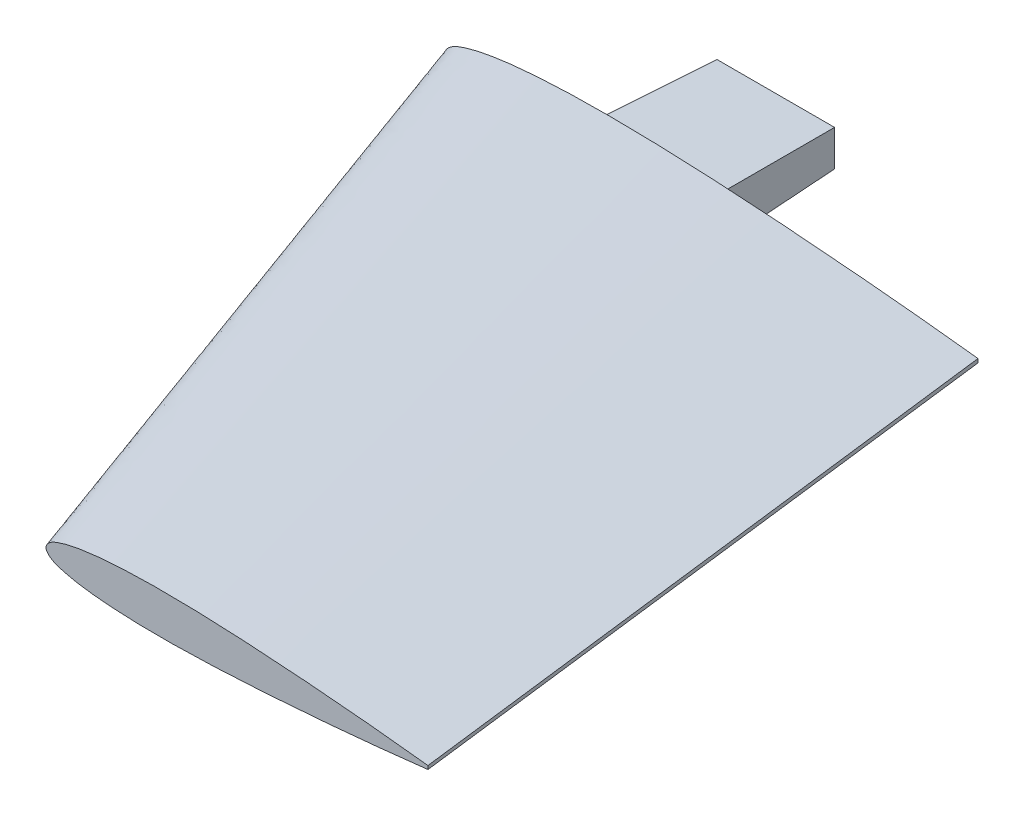
ISO-10303-21;
HEADER;
FILE_DESCRIPTION(('STEP AP214'),'2;1');
FILE_NAME('part.step','',(''),(''),'','','');
FILE_SCHEMA(('AUTOMOTIVE_DESIGN { 1 0 10303 214 1 1 1 1 }'));
ENDSEC;
DATA;
#1=APPLICATION_CONTEXT('core data for automotive mechanical design processes');
#2=APPLICATION_PROTOCOL_DEFINITION('international standard','automotive_design',2000,#1);
#3=PRODUCT_CONTEXT('',#1,'mechanical');
#4=PRODUCT('Part','Part','',(#3));
#5=PRODUCT_RELATED_PRODUCT_CATEGORY('part','',(#4));
#6=PRODUCT_DEFINITION_FORMATION('','',#4);
#7=PRODUCT_DEFINITION_CONTEXT('part definition',#1,'design');
#8=PRODUCT_DEFINITION('design','',#6,#7);
#9=PRODUCT_DEFINITION_SHAPE('','',#8);
#10=(LENGTH_UNIT() NAMED_UNIT(*) SI_UNIT(.MILLI.,.METRE.));
#11=(NAMED_UNIT(*) PLANE_ANGLE_UNIT() SI_UNIT($,.RADIAN.));
#12=(NAMED_UNIT(*) SI_UNIT($,.STERADIAN.) SOLID_ANGLE_UNIT());
#13=UNCERTAINTY_MEASURE_WITH_UNIT(LENGTH_MEASURE(1.E-05),#10,'distance_accuracy_value','');
#14=(GEOMETRIC_REPRESENTATION_CONTEXT(3) GLOBAL_UNCERTAINTY_ASSIGNED_CONTEXT((#13)) GLOBAL_UNIT_ASSIGNED_CONTEXT((#10,
#11,#12)) REPRESENTATION_CONTEXT('',''));
#15=CARTESIAN_POINT('',(0.,0.,0.));
#16=DIRECTION('',(0.,0.,1.));
#17=DIRECTION('',(1.,0.,0.));
#18=AXIS2_PLACEMENT_3D('',#15,#16,#17);
#19=CARTESIAN_POINT('',(247.141829047651,0.161785387878261,254.));
#20=DIRECTION('',(-0.992519701396033,-0.00106316623259715,0.122079941097178));
#21=DIRECTION('',(0.122080010092085,0.,0.992520262330153));
#22=AXIS2_PLACEMENT_3D('',#19,#20,#21);
#23=PLANE('',#22);
#24=DIRECTION('',(-0.122079942839747,5.66866074657592E-08,-0.992520270602188));
#25=VECTOR('',#24,1.);
#26=CARTESIAN_POINT('',(247.142575251506,-0.54299621225264,254.));
#27=LINE('',#26,#25);
#28=CARTESIAN_POINT('',(247.142575251506,-0.54299621225264,254.));
#29=VERTEX_POINT('',#28);
#30=CARTESIAN_POINT('',(215.900588160923,-0.542981705346612,0.));
#31=VERTEX_POINT('',#30);
#32=EDGE_CURVE('E106',#29,#31,#27,.T.);
#33=ORIENTED_EDGE('',*,*,#32,.T.);
#34=DIRECTION('',(0.00108254730317611,-0.999999414045497,0.));
#35=VECTOR('',#34,1.);
#36=CARTESIAN_POINT('',(215.900588160923,-0.542981705346612,0.));
#37=LINE('',#36,#35);
#38=CARTESIAN_POINT('',(215.898923080498,0.995130712382651,0.));
#39=VERTEX_POINT('',#38);
#40=EDGE_CURVE('E13',#39,#31,#37,.T.);
#41=ORIENTED_EDGE('',*,*,#40,.F.);
#42=DIRECTION('',(-0.12208059210774,0.000502370377528436,-0.992520063603063));
#43=VECTOR('',#42,1.);
#44=CARTESIAN_POINT('',(247.141082843796,0.866566988009162,254.));
#45=LINE('',#44,#43);
#46=CARTESIAN_POINT('',(247.141082843796,0.866566988009162,254.));
#47=VERTEX_POINT('',#46);
#48=EDGE_CURVE('E95',#47,#39,#45,.T.);
#49=ORIENTED_EDGE('',*,*,#48,.F.);
#50=DIRECTION('',(-0.00105877258540664,0.999999439500149,0.));
#51=VECTOR('',#50,1.);
#52=CARTESIAN_POINT('',(247.142575251506,-0.54299621225264,254.));
#53=LINE('',#52,#51);
#54=EDGE_CURVE('E115',#29,#47,#53,.T.);
#55=ORIENTED_EDGE('',*,*,#54,.F.);
#56=EDGE_LOOP('',(#33,#41,#49,#55));
#57=FACE_BOUND('',#56,.T.);
#58=ADVANCED_FACE('F75',(#57),#23,.F.);
#59=CARTESIAN_POINT('',(247.142575251506,-0.54299621225264,254.));
#60=CARTESIAN_POINT('',(215.900588160923,-0.542981705346612,0.));
#61=CARTESIAN_POINT('',(243.910925988562,-0.917335737105066,254.));
#62=CARTESIAN_POINT('',(211.38514245871,-1.06613915406456,0.));
#63=CARTESIAN_POINT('',(237.445920581505,-1.65165112657111,254.));
#64=CARTESIAN_POINT('',(202.354281544289,-2.10967948619344,0.));
#65=CARTESIAN_POINT('',(224.506683648929,-3.037064664137,254.));
#66=CARTESIAN_POINT('',(184.268861948541,-4.01484220296705,0.));
#67=CARTESIAN_POINT('',(208.310841147729,-4.56449438276227,254.));
#68=CARTESIAN_POINT('',(161.640749392609,-6.16198771185004,0.));
#69=CARTESIAN_POINT('',(192.097064273007,-5.87843774479329,254.));
#70=CARTESIAN_POINT('',(138.984151469245,-7.99262640125192,0.));
#71=CARTESIAN_POINT('',(179.11235993549,-6.7699489127731,254.));
#72=CARTESIAN_POINT('',(120.841149240871,-9.23772048275152,0.));
#73=CARTESIAN_POINT('',(169.366938336926,-7.34354462301356,254.));
#74=CARTESIAN_POINT('',(107.224496858897,-10.0381806332002,0.));
#75=CARTESIAN_POINT('',(159.614070620763,-7.80621002940426,254.));
#76=CARTESIAN_POINT('',(93.5980613997987,-10.6836415895626,0.));
#77=CARTESIAN_POINT('',(149.8531186885,-8.12863925669118,254.));
#78=CARTESIAN_POINT('',(79.9611074870669,-11.132991359372,0.));
#79=CARTESIAN_POINT('',(140.085217070112,-8.27325634781466,254.));
#80=CARTESIAN_POINT('',(66.3155155746222,-11.3338087442509,0.));
#81=CARTESIAN_POINT('',(131.94158508033,-8.20946949379574,254.));
#82=CARTESIAN_POINT('',(54.9401637056254,-11.2436224610168,0.));
#83=CARTESIAN_POINT('',(125.426796869335,-8.00540290612387,254.));
#84=CARTESIAN_POINT('',(45.8413665425327,-10.9576639434355,0.));
#85=CARTESIAN_POINT('',(120.542040134605,-7.76289044447715,254.));
#86=CARTESIAN_POINT('',(39.0198619138351,-10.6182704774013,0.));
#87=CARTESIAN_POINT('',(115.661557893058,-7.41169583505314,254.));
#88=CARTESIAN_POINT('',(32.2053397611574,-10.1271413611434,0.));
#89=CARTESIAN_POINT('',(111.599902459943,-7.00688245588788,254.));
#90=CARTESIAN_POINT('',(26.5358607479743,-9.56135650186109,0.));
#91=CARTESIAN_POINT('',(108.357258803685,-6.58942884182759,254.));
#92=CARTESIAN_POINT('',(22.0108571606815,-8.97821320581277,0.));
#93=CARTESIAN_POINT('',(105.928466612751,-6.22214610967325,254.));
#94=CARTESIAN_POINT('',(18.6225281555296,-8.46537510787293,0.));
#95=CARTESIAN_POINT('',(103.513974855878,-5.79494212142781,254.));
#96=CARTESIAN_POINT('',(15.2547286697036,-7.86903456570883,0.));
#97=CARTESIAN_POINT('',(101.106367307612,-5.28121752275446,254.));
#98=CARTESIAN_POINT('',(11.9013905424653,-7.1528278459514,0.));
#99=CARTESIAN_POINT('',(99.0911236798409,-4.7324955005918,254.));
#100=CARTESIAN_POINT('',(9.09675001513064,-6.38846884006219,0.));
#101=CARTESIAN_POINT('',(97.5135351150811,-4.21530637448921,254.));
#102=CARTESIAN_POINT('',(6.90404192123861,-5.66928349181277,0.));
#103=CARTESIAN_POINT('',(96.3745489526856,-3.8011414654002,254.));
#104=CARTESIAN_POINT('',(5.31810205875873,-5.0922112823648,0.));
#105=CARTESIAN_POINT('',(95.2258038536262,-3.30483563506069,254.));
#106=CARTESIAN_POINT('',(3.74012720417191,-4.40932855020977,0.));
#107=CARTESIAN_POINT('',(94.004507840121,-2.5340728838151,254.));
#108=CARTESIAN_POINT('',(2.06811101215859,-3.35293253643525,0.));
#109=CARTESIAN_POINT('',(93.0705187146577,-1.644080232563,254.));
#110=CARTESIAN_POINT('',(0.801666114714875,-2.14226110962261,0.));
#111=CARTESIAN_POINT('',(92.5705299949104,-0.780700388257798,254.));
#112=CARTESIAN_POINT('',(0.145032570195169,-1.00073127633852,0.));
#113=CARTESIAN_POINT('',(92.3991488857205,-0.00205201142186142,254.));
#114=CARTESIAN_POINT('',(-0.0719765710733895,-0.00772524953636053,0.));
#115=CARTESIAN_POINT('',(92.5688807884886,0.77695752672214,254.));
#116=CARTESIAN_POINT('',(0.142882110833665,0.985748294886877,0.));
#117=CARTESIAN_POINT('',(93.0670401424671,1.64139418343598,254.));
#118=CARTESIAN_POINT('',(0.797042597689074,2.12869712554513,0.));
#119=CARTESIAN_POINT('',(93.9991425753443,2.53336260237854,254.));
#120=CARTESIAN_POINT('',(2.06086331017878,3.34210768617307,0.));
#121=CARTESIAN_POINT('',(95.2188037266792,3.30670977359997,254.));
#122=CARTESIAN_POINT('',(3.73058838732209,4.40212129506356,0.));
#123=CARTESIAN_POINT('',(96.3664953008289,3.80544700949496,254.));
#124=CARTESIAN_POINT('',(5.30708103857153,5.08841888950836,0.));
#125=CARTESIAN_POINT('',(97.5046018972076,4.22202284332155,254.));
#126=CARTESIAN_POINT('',(6.891767768703,5.66892345423201,0.));
#127=CARTESIAN_POINT('',(99.0810917542938,4.74255142305962,254.));
#128=CARTESIAN_POINT('',(9.082913619883,6.3928545345242,0.));
#129=CARTESIAN_POINT('',(101.095168920875,5.2955395820063,254.));
#130=CARTESIAN_POINT('',(11.8858926650627,7.16328405741109,0.));
#131=CARTESIAN_POINT('',(103.501683236855,5.81436124378679,254.));
#132=CARTESIAN_POINT('',(15.2376722782929,7.88674938854334,0.));
#133=CARTESIAN_POINT('',(105.915264957205,6.24667706673299,254.));
#134=CARTESIAN_POINT('',(18.6041727376783,8.49038013321777,0.));
#135=CARTESIAN_POINT('',(108.343273965451,6.61910204972956,254.));
#136=CARTESIAN_POINT('',(21.9913834588577,9.0105530777079,0.));
#137=CARTESIAN_POINT('',(111.585026375318,7.04342116842241,254.));
#138=CARTESIAN_POINT('',(26.5151138807045,9.60349206208692,0.));
#139=CARTESIAN_POINT('',(115.645815492071,7.45683437401958,254.));
#140=CARTESIAN_POINT('',(32.1833546286361,10.1815505465027,0.));
#141=CARTESIAN_POINT('',(120.52554312155,7.81836283187002,254.));
#142=CARTESIAN_POINT('',(38.996797468942,10.6874325881442,0.));
#143=CARTESIAN_POINT('',(125.409775373857,8.0712184370357,254.));
#144=CARTESIAN_POINT('',(45.8175512907472,11.0415944529149,0.));
#145=CARTESIAN_POINT('',(131.92411685873,8.28907991776664,254.));
#146=CARTESIAN_POINT('',(54.9157080010407,11.3472520453647,0.));
#147=CARTESIAN_POINT('',(140.067595519031,8.3701111276945,254.));
#148=CARTESIAN_POINT('',(66.29083794657,11.4620668157445,0.));
#149=CARTESIAN_POINT('',(149.835781470846,8.24617832210001,254.));
#150=CARTESIAN_POINT('',(79.9368326646221,11.2907938816596,0.));
#151=CARTESIAN_POINT('',(159.597394277137,7.94441906273065,254.));
#152=CARTESIAN_POINT('',(93.5747274990171,10.8709704430832,0.));
#153=CARTESIAN_POINT('',(169.35121984173,7.50240681998367,254.));
#154=CARTESIAN_POINT('',(107.202528503455,10.2550135041687,0.));
#155=CARTESIAN_POINT('',(179.097834205216,6.94944875461104,254.));
#156=CARTESIAN_POINT('',(120.82088204142,9.48403655318264,0.));
#157=CARTESIAN_POINT('',(192.084397245152,6.08543526793793,254.));
#158=CARTESIAN_POINT('',(138.96653749081,8.27822668317501,0.));
#159=CARTESIAN_POINT('',(208.300920101466,4.80582823742755,254.));
#160=CARTESIAN_POINT('',(161.627045814875,6.49664593363513,0.));
#161=CARTESIAN_POINT('',(224.499960691216,3.31269735213436,254.));
#162=CARTESIAN_POINT('',(184.259754105077,4.39849743296909,0.));
#163=CARTESIAN_POINT('',(237.442102288139,1.95468632397389,254.));
#164=CARTESIAN_POINT('',(202.349256167007,2.53249580299357,0.));
#165=CARTESIAN_POINT('',(243.908648145797,1.23406251414122,254.));
#166=CARTESIAN_POINT('',(211.382355276958,1.50851057351643,0.));
#167=CARTESIAN_POINT('',(247.141082843796,0.866566988009162,254.));
#168=CARTESIAN_POINT('',(215.898923080498,0.995130712382651,0.));
#169=B_SPLINE_SURFACE_WITH_KNOTS('',3,1,((#59,#60),(#61,#62),(#63,#64),(#65,#66),(#67,#68),(#69,
#70),(#71,#72),(#73,#74),(#75,#76),(#77,#78),(#79,#80),(#81,#82),(#83,#84),(#85,#86),(#87,#88),
(#89,#90),(#91,#92),(#93,#94),(#95,#96),(#97,#98),(#99,#100),(#101,#102),(#103,#104),(#105,
#106),(#107,#108),(#109,#110),(#111,#112),(#113,#114),(#115,#116),(#117,#118),(#119,#120),(#121,
#122),(#123,#124),(#125,#126),(#127,#128),(#129,#130),(#131,#132),(#133,#134),(#135,#136),(#137,
#138),(#139,#140),(#141,#142),(#143,#144),(#145,#146),(#147,#148),(#149,#150),(#151,#152),(#153,
#154),(#155,#156),(#157,#158),(#159,#160),(#161,#162),(#163,#164),(#165,#166),(#167,#168)),
.UNSPECIFIED.,.F.,.F.,.F.,(4,1,1,1,1,1,1,1,1,1,1,1,1,1,1,1,1,1,1,1,1,1,1,1,1,1,1,1,1,1,1,1,1,1,
1,1,1,1,1,1,1,1,1,1,1,1,1,1,1,1,1,1,4),(2,2),(0.,0.03125,0.0624999999999999,0.125,0.1875,
0.21875,0.25,0.28125,0.3125,0.34375,0.375,0.390625,0.40625,0.421875,0.4375,0.4453125,0.453125,
0.4609375,0.46875,0.4765625,0.48046875,0.484375,0.48828125,0.4921875,0.49609375,0.498046875,0.5,
0.501953125,0.50390625,0.5078125,0.51171875,0.515625,0.51953125,0.5234375,0.53125,0.5390625,
0.546875,0.5546875,0.5625,0.578125,0.59375,0.609375,0.625,0.65625,0.6875,0.71875,0.75,0.78125,
0.8125,0.875,0.9375,0.96875,1.),(0.,1.),.UNSPECIFIED.);
#170=CARTESIAN_POINT('',(247.141082843796,0.866566988009162,254.));
#171=CARTESIAN_POINT('',(240.676213447797,1.60155804027328,254.));
#172=CARTESIAN_POINT('',(227.739768809166,3.01407117507572,254.));
#173=CARTESIAN_POINT('',(208.300920101466,4.80582823742755,254.));
#174=CARTESIAN_POINT('',(192.084397245152,6.08543526793793,254.));
#175=CARTESIAN_POINT('',(179.097834205216,6.94944875461104,254.));
#176=CARTESIAN_POINT('',(169.35121984173,7.50240681998367,254.));
#177=CARTESIAN_POINT('',(159.597394277137,7.94441906273065,254.));
#178=CARTESIAN_POINT('',(149.835781470846,8.24617832210001,254.));
#179=CARTESIAN_POINT('',(140.067595519031,8.3701111276945,254.));
#180=CARTESIAN_POINT('',(131.92411685873,8.28907991776664,254.));
#181=CARTESIAN_POINT('',(125.409775373857,8.0712184370357,254.));
#182=CARTESIAN_POINT('',(120.52554312155,7.81836283187002,254.));
#183=CARTESIAN_POINT('',(115.645815492071,7.45683437401958,254.));
#184=CARTESIAN_POINT('',(111.585026375318,7.04342116842241,254.));
#185=CARTESIAN_POINT('',(108.343273965451,6.61910204972956,254.));
#186=CARTESIAN_POINT('',(105.915264957205,6.24667706673299,254.));
#187=CARTESIAN_POINT('',(103.501683236855,5.81436124378679,254.));
#188=CARTESIAN_POINT('',(101.095168920875,5.2955395820063,254.));
#189=CARTESIAN_POINT('',(99.0810917542938,4.74255142305962,254.));
#190=CARTESIAN_POINT('',(97.5046018972076,4.22202284332155,254.));
#191=CARTESIAN_POINT('',(96.3664953008289,3.80544700949496,254.));
#192=CARTESIAN_POINT('',(95.2188037266792,3.30670977359997,254.));
#193=CARTESIAN_POINT('',(93.9991425753443,2.53336260237854,254.));
#194=CARTESIAN_POINT('',(93.0670401424671,1.64139418343598,254.));
#195=CARTESIAN_POINT('',(92.5688807884886,0.77695752672214,254.));
#196=CARTESIAN_POINT('',(92.3991488857205,-0.00205201142186142,254.));
#197=CARTESIAN_POINT('',(92.5705299949104,-0.780700388257798,254.));
#198=CARTESIAN_POINT('',(93.0705187146577,-1.644080232563,254.));
#199=CARTESIAN_POINT('',(94.004507840121,-2.5340728838151,254.));
#200=CARTESIAN_POINT('',(95.2258038536262,-3.30483563506069,254.));
#201=CARTESIAN_POINT('',(96.3745489526856,-3.8011414654002,254.));
#202=CARTESIAN_POINT('',(97.5135351150811,-4.21530637448921,254.));
#203=CARTESIAN_POINT('',(99.0911236798409,-4.7324955005918,254.));
#204=CARTESIAN_POINT('',(101.106367307612,-5.28121752275446,254.));
#205=CARTESIAN_POINT('',(103.513974855878,-5.79494212142781,254.));
#206=CARTESIAN_POINT('',(105.928466612751,-6.22214610967325,254.));
#207=CARTESIAN_POINT('',(108.357258803685,-6.58942884182759,254.));
#208=CARTESIAN_POINT('',(111.599902459943,-7.00688245588788,254.));
#209=CARTESIAN_POINT('',(115.661557893058,-7.41169583505314,254.));
#210=CARTESIAN_POINT('',(120.542040134605,-7.76289044447715,254.));
#211=CARTESIAN_POINT('',(125.426796869335,-8.00540290612387,254.));
#212=CARTESIAN_POINT('',(131.94158508033,-8.20946949379574,254.));
#213=CARTESIAN_POINT('',(140.085217070112,-8.27325634781466,254.));
#214=CARTESIAN_POINT('',(149.8531186885,-8.12863925669118,254.));
#215=CARTESIAN_POINT('',(159.614070620763,-7.80621002940426,254.));
#216=CARTESIAN_POINT('',(169.366938336926,-7.34354462301356,254.));
#217=CARTESIAN_POINT('',(179.11235993549,-6.7699489127731,254.));
#218=CARTESIAN_POINT('',(192.097064273007,-5.87843774479329,254.));
#219=CARTESIAN_POINT('',(208.310841147729,-4.56449438276227,254.));
#220=CARTESIAN_POINT('',(227.745852149168,-2.73157872041195,254.));
#221=CARTESIAN_POINT('',(240.679276725617,-1.29167526195749,254.));
#222=CARTESIAN_POINT('',(247.142575251506,-0.54299621225264,254.));
#223=B_SPLINE_CURVE_WITH_KNOTS('',3,(#170,#171,#172,#173,#174,#175,#176,#177,#178,#179,#180,
#181,#182,#183,#184,#185,#186,#187,#188,#189,#190,#191,#192,#193,#194,#195,#196,#197,#198,#199,
#200,#201,#202,#203,#204,#205,#206,#207,#208,#209,#210,#211,#212,#213,#214,#215,#216,#217,#218,
#219,#220,#221,#222),.UNSPECIFIED.,.F.,.F.,(4,1,1,1,1,1,1,1,1,1,1,1,1,1,1,1,1,1,1,1,1,1,1,1,1,1,
1,1,1,1,1,1,1,1,1,1,1,1,1,1,1,1,1,1,1,1,1,1,1,1,4),(-0.00174749738225885,0.0609709397905237,
0.123689376963306,0.186407814136089,0.21776703272248,0.249126251308871,0.280485469895263,
0.311844688481654,0.343203907068045,0.374563125654436,0.390242734947632,0.405922344240828,
0.421601953534023,0.437281562827219,0.445121367473817,0.452961172120414,0.460800976767012,
0.46864078141361,0.476480586060208,0.480400488383507,0.484320390706806,0.488240293030105,
0.492160195353403,0.496080097676702,0.498040048838352,0.500000000000001,0.501959951161651,
0.5039199023233,0.507839804646599,0.511759706969898,0.515679609293197,0.519599511616496,
0.523519413939795,0.531359218586393,0.53919902323299,0.547038827879588,0.554878632526186,
0.562718437172784,0.578398046465979,0.594077655759175,0.609757265052371,0.625436874345566,
0.656796092931958,0.688155311518349,0.71951453010474,0.750873748691131,0.782232967277523,
0.813592185863914,0.876310623036696,0.939029060209479,1.00174749738226),.UNSPECIFIED.);
#224=EDGE_CURVE('E110',#47,#29,#223,.T.);
#225=CARTESIAN_POINT('',(215.900588160923,-0.542981705346612,0.));
#226=CARTESIAN_POINT('',(211.38514245871,-1.06613915406456,0.));
#227=CARTESIAN_POINT('',(202.354281544289,-2.10967948619344,0.));
#228=CARTESIAN_POINT('',(184.268861948541,-4.01484220296705,0.));
#229=CARTESIAN_POINT('',(161.640749392609,-6.16198771185004,0.));
#230=CARTESIAN_POINT('',(138.984151469245,-7.99262640125192,0.));
#231=CARTESIAN_POINT('',(120.841149240871,-9.23772048275152,0.));
#232=CARTESIAN_POINT('',(107.224496858897,-10.0381806332002,0.));
#233=CARTESIAN_POINT('',(93.5980613997987,-10.6836415895626,0.));
#234=CARTESIAN_POINT('',(79.9611074870669,-11.132991359372,0.));
#235=CARTESIAN_POINT('',(66.3155155746222,-11.3338087442509,0.));
#236=CARTESIAN_POINT('',(54.9401637056254,-11.2436224610168,0.));
#237=CARTESIAN_POINT('',(45.8413665425327,-10.9576639434355,0.));
#238=CARTESIAN_POINT('',(39.0198619138351,-10.6182704774013,0.));
#239=CARTESIAN_POINT('',(32.2053397611574,-10.1271413611434,0.));
#240=CARTESIAN_POINT('',(26.5358607479743,-9.56135650186109,0.));
#241=CARTESIAN_POINT('',(22.0108571606815,-8.97821320581277,0.));
#242=CARTESIAN_POINT('',(18.6225281555296,-8.46537510787293,0.));
#243=CARTESIAN_POINT('',(15.2547286697036,-7.86903456570883,0.));
#244=CARTESIAN_POINT('',(11.9013905424653,-7.1528278459514,0.));
#245=CARTESIAN_POINT('',(9.09675001513064,-6.38846884006219,0.));
#246=CARTESIAN_POINT('',(6.90404192123861,-5.66928349181277,0.));
#247=CARTESIAN_POINT('',(5.31810205875873,-5.0922112823648,0.));
#248=CARTESIAN_POINT('',(3.74012720417191,-4.40932855020977,0.));
#249=CARTESIAN_POINT('',(2.06811101215859,-3.35293253643525,0.));
#250=CARTESIAN_POINT('',(0.801666114714875,-2.14226110962261,0.));
#251=CARTESIAN_POINT('',(0.145032570195169,-1.00073127633852,0.));
#252=CARTESIAN_POINT('',(-0.0719765710733895,-0.00772524953636053,0.));
#253=CARTESIAN_POINT('',(0.142882110833665,0.985748294886877,0.));
#254=CARTESIAN_POINT('',(0.797042597689074,2.12869712554513,0.));
#255=CARTESIAN_POINT('',(2.06086331017878,3.34210768617307,0.));
#256=CARTESIAN_POINT('',(3.73058838732209,4.40212129506356,0.));
#257=CARTESIAN_POINT('',(5.30708103857153,5.08841888950836,0.));
#258=CARTESIAN_POINT('',(6.891767768703,5.66892345423201,0.));
#259=CARTESIAN_POINT('',(9.082913619883,6.3928545345242,0.));
#260=CARTESIAN_POINT('',(11.8858926650627,7.16328405741109,0.));
#261=CARTESIAN_POINT('',(15.2376722782929,7.88674938854334,0.));
#262=CARTESIAN_POINT('',(18.6041727376783,8.49038013321777,0.));
#263=CARTESIAN_POINT('',(21.9913834588577,9.0105530777079,0.));
#264=CARTESIAN_POINT('',(26.5151138807045,9.60349206208692,0.));
#265=CARTESIAN_POINT('',(32.1833546286361,10.1815505465027,0.));
#266=CARTESIAN_POINT('',(38.996797468942,10.6874325881442,0.));
#267=CARTESIAN_POINT('',(45.8175512907472,11.0415944529149,0.));
#268=CARTESIAN_POINT('',(54.9157080010407,11.3472520453647,0.));
#269=CARTESIAN_POINT('',(66.29083794657,11.4620668157445,0.));
#270=CARTESIAN_POINT('',(79.9368326646221,11.2907938816596,0.));
#271=CARTESIAN_POINT('',(93.5747274990171,10.8709704430832,0.));
#272=CARTESIAN_POINT('',(107.202528503455,10.2550135041687,0.));
#273=CARTESIAN_POINT('',(120.82088204142,9.48403655318264,0.));
#274=CARTESIAN_POINT('',(138.96653749081,8.27822668317501,0.));
#275=CARTESIAN_POINT('',(161.627045814875,6.49664593363513,0.));
#276=CARTESIAN_POINT('',(184.259754105077,4.39849743296909,0.));
#277=CARTESIAN_POINT('',(202.349256167007,2.53249580299357,0.));
#278=CARTESIAN_POINT('',(211.382355276958,1.50851057351643,0.));
#279=CARTESIAN_POINT('',(215.898923080498,0.995130712382651,0.));
#280=B_SPLINE_CURVE_WITH_KNOTS('',3,(#225,#226,#227,#228,#229,#230,#231,#232,#233,#234,#235,
#236,#237,#238,#239,#240,#241,#242,#243,#244,#245,#246,#247,#248,#249,#250,#251,#252,#253,#254,
#255,#256,#257,#258,#259,#260,#261,#262,#263,#264,#265,#266,#267,#268,#269,#270,#271,#272,#273,
#274,#275,#276,#277,#278,#279),.UNSPECIFIED.,.F.,.F.,(4,1,1,1,1,1,1,1,1,1,1,1,1,1,1,1,1,1,1,1,1,
1,1,1,1,1,1,1,1,1,1,1,1,1,1,1,1,1,1,1,1,1,1,1,1,1,1,1,1,1,1,1,4),(-0.00124921665648959,
0.0300788593845411,0.0614069354255718,0.124063087507633,0.186719239589694,0.218047315630725,
0.249375391671756,0.280703467712787,0.312031543753817,0.343359619794848,0.374687695835879,
0.390351733856394,0.406015771876909,0.421679809897425,0.43734384791794,0.445175866928198,
0.453007885938455,0.460839904948713,0.468671923958971,0.476503942969228,0.480419952474357,
0.484335961979486,0.488251971484615,0.492167980989744,0.496083990494873,0.498041995247437,
0.500000000000001,0.501958004752566,0.50391600950513,0.507832019010259,0.511748028515388,
0.515664038020517,0.519580047525645,0.523496057030774,0.531328076041032,0.53916009505129,
0.546992114061547,0.554824133071805,0.562656152082063,0.578320190102578,0.593984228123093,
0.609648266143609,0.625312304164124,0.656640380205155,0.687968456246185,0.719296532287216,
0.750624608328247,0.781952684369277,0.813280760410308,0.875936912492369,0.938593064574431,
0.969921140615461,1.00124921665649),.UNSPECIFIED.);
#281=EDGE_CURVE('E87',#31,#39,#280,.T.);
#282=ORIENTED_EDGE('',*,*,#224,.F.);
#283=ORIENTED_EDGE('',*,*,#48,.T.);
#284=ORIENTED_EDGE('',*,*,#281,.F.);
#285=ORIENTED_EDGE('',*,*,#32,.F.);
#286=EDGE_LOOP('',(#282,#283,#284,#285));
#287=FACE_BOUND('',#286,.T.);
#288=ADVANCED_FACE('F108',(#287),#169,.T.);
#289=CARTESIAN_POINT('',(93.0656007126994,-0.00134639010220314,254.));
#290=DIRECTION('',(0.,0.,-1.));
#291=DIRECTION('',(-1.,0.,0.));
#292=AXIS2_PLACEMENT_3D('',#289,#290,#291);
#293=PLANE('',#292);
#294=ORIENTED_EDGE('',*,*,#224,.T.);
#295=ORIENTED_EDGE('',*,*,#54,.T.);
#296=EDGE_LOOP('',(#294,#295));
#297=FACE_BOUND('',#296,.T.);
#298=ADVANCED_FACE('F124',(#297),#293,.F.);
#299=CARTESIAN_POINT('',(0.609601042258013,-0.00698740909672397,0.));
#300=DIRECTION('',(0.,0.,-1.));
#301=DIRECTION('',(-1.,0.,0.));
#302=AXIS2_PLACEMENT_3D('',#299,#300,#301);
#303=PLANE('',#302);
#304=ORIENTED_EDGE('',*,*,#281,.T.);
#305=ORIENTED_EDGE('',*,*,#40,.T.);
#306=EDGE_LOOP('',(#304,#305));
#307=FACE_BOUND('',#306,.T.);
#308=ADVANCED_FACE('F77',(#307),#303,.T.);
#309=CLOSED_SHELL('',(#58,#288,#298,#308));
#310=MANIFOLD_SOLID_BREP('B2',#309);
#311=CARTESIAN_POINT('',(62.8904,-8.89,0.));
#312=DIRECTION('',(-0.999390827019096,0.,-0.0348994967025011));
#313=DIRECTION('',(-0.0348994967025011,0.,0.999390827019096));
#314=AXIS2_PLACEMENT_3D('',#311,#312,#313);
#315=PLANE('',#314);
#316=DIRECTION('',(0.,1.,0.));
#317=VECTOR('',#316,1.);
#318=CARTESIAN_POINT('',(62.8904,-8.89,0.));
#319=LINE('',#318,#317);
#320=CARTESIAN_POINT('',(62.8904,-8.89,0.));
#321=VERTEX_POINT('',#320);
#322=CARTESIAN_POINT('',(62.8904,8.89,0.));
#323=VERTEX_POINT('',#322);
#324=EDGE_CURVE('E320',#321,#323,#319,.T.);
#325=ORIENTED_EDGE('',*,*,#324,.T.);
#326=DIRECTION('',(-0.0348782627423747,0.0348782627423747,0.998782765958718));
#327=VECTOR('',#326,1.);
#328=CARTESIAN_POINT('',(62.9521978551658,8.82820214483415,-1.76965903287013));
#329=LINE('',#328,#327);
#330=CARTESIAN_POINT('',(64.4869775811627,7.29342241883729,-45.72));
#331=VERTEX_POINT('',#330);
#332=EDGE_CURVE('E73',#331,#323,#329,.T.);
#333=ORIENTED_EDGE('',*,*,#332,.F.);
#334=DIRECTION('',(0.,-1.,0.));
#335=VECTOR('',#334,1.);
#336=CARTESIAN_POINT('',(64.4869775811627,0.,-45.72));
#337=LINE('',#336,#335);
#338=CARTESIAN_POINT('',(64.4869775811627,-7.29342241883729,-45.72));
#339=VERTEX_POINT('',#338);
#340=EDGE_CURVE('E336',#339,#331,#337,.F.);
#341=ORIENTED_EDGE('',*,*,#340,.F.);
#342=DIRECTION('',(-0.0348782627423747,-0.0348782627423747,0.998782765958718));
#343=VECTOR('',#342,1.);
#344=CARTESIAN_POINT('',(62.8904,-8.89,0.));
#345=LINE('',#344,#343);
#346=EDGE_CURVE('E331',#339,#321,#345,.T.);
#347=ORIENTED_EDGE('',*,*,#346,.T.);
#348=EDGE_LOOP('',(#325,#333,#341,#347));
#349=FACE_BOUND('',#348,.T.);
#350=ADVANCED_FACE('F274',(#349),#315,.T.);
#351=CARTESIAN_POINT('',(113.6904,8.89,0.));
#352=DIRECTION('',(0.,0.999390827019096,-0.0348994967025011));
#353=DIRECTION('',(0.,0.0348994967025011,0.999390827019096));
#354=AXIS2_PLACEMENT_3D('',#351,#352,#353);
#355=PLANE('',#354);
#356=DIRECTION('',(1.,0.,0.));
#357=VECTOR('',#356,1.);
#358=CARTESIAN_POINT('',(113.6904,8.89,0.));
#359=LINE('',#358,#357);
#360=CARTESIAN_POINT('',(113.6904,8.89,0.));
#361=VERTEX_POINT('',#360);
#362=EDGE_CURVE('E316',#323,#361,#359,.T.);
#363=ORIENTED_EDGE('',*,*,#362,.T.);
#364=DIRECTION('',(0.0348782627423747,0.0348782627423747,0.998782765958718));
#365=VECTOR('',#364,1.);
#366=CARTESIAN_POINT('',(113.668770750692,8.86837075069195,-0.619380661504545));
#367=LINE('',#366,#365);
#368=CARTESIAN_POINT('',(112.093822418837,7.29342241883729,-45.72));
#369=VERTEX_POINT('',#368);
#370=EDGE_CURVE('E283',#369,#361,#367,.T.);
#371=ORIENTED_EDGE('',*,*,#370,.F.);
#372=DIRECTION('',(-1.,0.,0.));
#373=VECTOR('',#372,1.);
#374=CARTESIAN_POINT('',(0.,7.29342241883729,-45.72));
#375=LINE('',#374,#373);
#376=EDGE_CURVE('E327',#331,#369,#375,.F.);
#377=ORIENTED_EDGE('',*,*,#376,.F.);
#378=ORIENTED_EDGE('',*,*,#332,.T.);
#379=EDGE_LOOP('',(#363,#371,#377,#378));
#380=FACE_BOUND('',#379,.T.);
#381=ADVANCED_FACE('F276',(#380),#355,.T.);
#382=CARTESIAN_POINT('',(113.6904,-8.89,0.));
#383=DIRECTION('',(0.999390827019096,0.,-0.0348994967025011));
#384=DIRECTION('',(-0.0348994967025011,0.,-0.999390827019096));
#385=AXIS2_PLACEMENT_3D('',#382,#383,#384);
#386=PLANE('',#385);
#387=DIRECTION('',(0.,-1.,0.));
#388=VECTOR('',#387,1.);
#389=CARTESIAN_POINT('',(113.6904,-8.89,0.));
#390=LINE('',#389,#388);
#391=CARTESIAN_POINT('',(113.6904,-8.89,0.));
#392=VERTEX_POINT('',#391);
#393=EDGE_CURVE('E321',#361,#392,#390,.T.);
#394=ORIENTED_EDGE('',*,*,#393,.T.);
#395=DIRECTION('',(0.0348782627423747,-0.0348782627423747,0.998782765958718));
#396=VECTOR('',#395,1.);
#397=CARTESIAN_POINT('',(113.6904,-8.89,0.));
#398=LINE('',#397,#396);
#399=CARTESIAN_POINT('',(112.093822418837,-7.29342241883729,-45.72));
#400=VERTEX_POINT('',#399);
#401=EDGE_CURVE('E339',#400,#392,#398,.T.);
#402=ORIENTED_EDGE('',*,*,#401,.F.);
#403=DIRECTION('',(0.,1.,0.));
#404=VECTOR('',#403,1.);
#405=CARTESIAN_POINT('',(112.093822418837,0.,-45.72));
#406=LINE('',#405,#404);
#407=EDGE_CURVE('E295',#369,#400,#406,.F.);
#408=ORIENTED_EDGE('',*,*,#407,.F.);
#409=ORIENTED_EDGE('',*,*,#370,.T.);
#410=EDGE_LOOP('',(#394,#402,#408,#409));
#411=FACE_BOUND('',#410,.T.);
#412=ADVANCED_FACE('F346',(#411),#386,.T.);
#413=CARTESIAN_POINT('',(113.6904,-8.89,0.));
#414=DIRECTION('',(0.,-0.999390827019096,-0.0348994967025011));
#415=DIRECTION('',(0.,0.0348994967025011,-0.999390827019096));
#416=AXIS2_PLACEMENT_3D('',#413,#414,#415);
#417=PLANE('',#416);
#418=DIRECTION('',(-1.,0.,0.));
#419=VECTOR('',#418,1.);
#420=CARTESIAN_POINT('',(113.6904,-8.89,0.));
#421=LINE('',#420,#419);
#422=EDGE_CURVE('E335',#392,#321,#421,.T.);
#423=ORIENTED_EDGE('',*,*,#422,.T.);
#424=ORIENTED_EDGE('',*,*,#346,.F.);
#425=DIRECTION('',(1.,0.,0.));
#426=VECTOR('',#425,1.);
#427=CARTESIAN_POINT('',(0.,-7.29342241883729,-45.72));
#428=LINE('',#427,#426);
#429=EDGE_CURVE('E278',#400,#339,#428,.F.);
#430=ORIENTED_EDGE('',*,*,#429,.F.);
#431=ORIENTED_EDGE('',*,*,#401,.T.);
#432=EDGE_LOOP('',(#423,#424,#430,#431));
#433=FACE_BOUND('',#432,.T.);
#434=ADVANCED_FACE('F348',(#433),#417,.T.);
#435=CARTESIAN_POINT('',(0.,0.,-45.72));
#436=DIRECTION('',(0.,0.,1.));
#437=DIRECTION('',(1.,0.,0.));
#438=AXIS2_PLACEMENT_3D('',#435,#436,#437);
#439=PLANE('',#438);
#440=ORIENTED_EDGE('',*,*,#340,.T.);
#441=ORIENTED_EDGE('',*,*,#376,.T.);
#442=ORIENTED_EDGE('',*,*,#407,.T.);
#443=ORIENTED_EDGE('',*,*,#429,.T.);
#444=EDGE_LOOP('',(#440,#441,#442,#443));
#445=FACE_BOUND('',#444,.T.);
#446=ADVANCED_FACE('F344',(#445),#439,.F.);
#447=CARTESIAN_POINT('',(0.,0.,0.));
#448=DIRECTION('',(0.,0.,1.));
#449=DIRECTION('',(1.,0.,0.));
#450=AXIS2_PLACEMENT_3D('',#447,#448,#449);
#451=PLANE('',#450);
#452=ORIENTED_EDGE('',*,*,#324,.F.);
#453=ORIENTED_EDGE('',*,*,#422,.F.);
#454=ORIENTED_EDGE('',*,*,#393,.F.);
#455=ORIENTED_EDGE('',*,*,#362,.F.);
#456=EDGE_LOOP('',(#452,#453,#454,#455));
#457=FACE_BOUND('',#456,.T.);
#458=ADVANCED_FACE('F317',(#457),#451,.T.);
#459=CLOSED_SHELL('',(#350,#381,#412,#434,#446,#458));
#460=MANIFOLD_SOLID_BREP('B7',#459);
#461=ADVANCED_BREP_SHAPE_REPRESENTATION('',(#18,#310,#460),#14);
#462=SHAPE_DEFINITION_REPRESENTATION(#9,#461);
ENDSEC;
END-ISO-10303-21;
